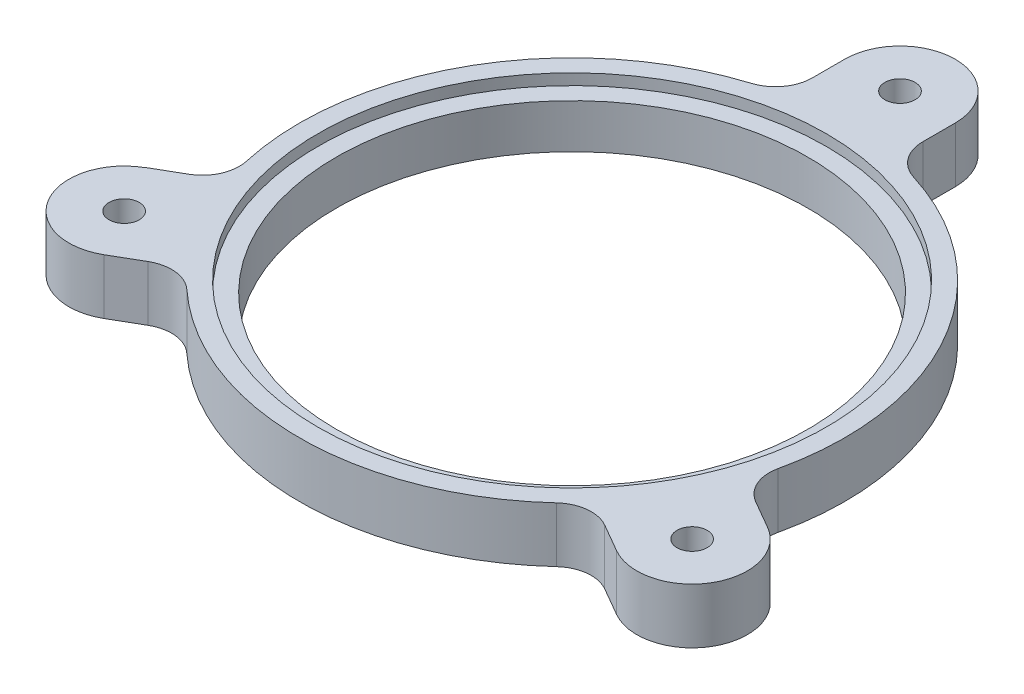
ISO-10303-21;
HEADER;
FILE_DESCRIPTION(('STEP AP214'),'2;1');
FILE_NAME('part.step','',(''),(''),'','','');
FILE_SCHEMA(('AUTOMOTIVE_DESIGN { 1 0 10303 214 1 1 1 1 }'));
ENDSEC;
DATA;
#1=APPLICATION_CONTEXT('core data for automotive mechanical design processes');
#2=APPLICATION_PROTOCOL_DEFINITION('international standard','automotive_design',2000,#1);
#3=PRODUCT_CONTEXT('',#1,'mechanical');
#4=PRODUCT('Part','Part','',(#3));
#5=PRODUCT_RELATED_PRODUCT_CATEGORY('part','',(#4));
#6=PRODUCT_DEFINITION_FORMATION('','',#4);
#7=PRODUCT_DEFINITION_CONTEXT('part definition',#1,'design');
#8=PRODUCT_DEFINITION('design','',#6,#7);
#9=PRODUCT_DEFINITION_SHAPE('','',#8);
#10=(LENGTH_UNIT() NAMED_UNIT(*) SI_UNIT(.MILLI.,.METRE.));
#11=(NAMED_UNIT(*) PLANE_ANGLE_UNIT() SI_UNIT($,.RADIAN.));
#12=(NAMED_UNIT(*) SI_UNIT($,.STERADIAN.) SOLID_ANGLE_UNIT());
#13=UNCERTAINTY_MEASURE_WITH_UNIT(LENGTH_MEASURE(1.E-05),#10,'distance_accuracy_value','');
#14=(GEOMETRIC_REPRESENTATION_CONTEXT(3) GLOBAL_UNCERTAINTY_ASSIGNED_CONTEXT((#13)) GLOBAL_UNIT_ASSIGNED_CONTEXT((#10,
#11,#12)) REPRESENTATION_CONTEXT('',''));
#15=CARTESIAN_POINT('',(0.,0.,0.));
#16=DIRECTION('',(0.,0.,1.));
#17=DIRECTION('',(1.,0.,0.));
#18=AXIS2_PLACEMENT_3D('',#15,#16,#17);
#19=CARTESIAN_POINT('',(77.0762609368114,15.,44.4999999999995));
#20=DIRECTION('',(0.,1.,0.));
#21=DIRECTION('',(0.,0.,1.));
#22=AXIS2_PLACEMENT_3D('',#19,#20,#21);
#23=PLANE('',#22);
#24=CARTESIAN_POINT('',(77.0762609368114,15.,44.4999999999995));
#25=DIRECTION('',(0.,1.,0.));
#26=DIRECTION('',(0.,0.,1.));
#27=AXIS2_PLACEMENT_3D('',#24,#25,#26);
#28=CIRCLE('',#27,4.1);
#29=CARTESIAN_POINT('',(77.0762609368114,15.,48.5999999999995));
#30=VERTEX_POINT('',#29);
#31=EDGE_CURVE('E701',#30,#30,#28,.T.);
#32=ORIENTED_EDGE('',*,*,#31,.F.);
#33=EDGE_LOOP('',(#32));
#34=FACE_BOUND('',#33,.T.);
#35=CARTESIAN_POINT('',(0.,15.,0.));
#36=DIRECTION('',(0.,1.,0.));
#37=DIRECTION('',(0.,0.,1.));
#38=AXIS2_PLACEMENT_3D('',#35,#36,#37);
#39=CIRCLE('',#38,69.);
#40=CARTESIAN_POINT('',(0.,15.,69.));
#41=VERTEX_POINT('',#40);
#42=EDGE_CURVE('E215',#41,#41,#39,.T.);
#43=ORIENTED_EDGE('',*,*,#42,.F.);
#44=EDGE_LOOP('',(#43));
#45=FACE_BOUND('',#44,.T.);
#46=CARTESIAN_POINT('',(77.0762609368114,15.,44.4999999999995));
#47=DIRECTION('',(0.,1.,0.));
#48=DIRECTION('',(0.,0.,1.));
#49=AXIS2_PLACEMENT_3D('',#46,#47,#48);
#50=CIRCLE('',#49,14.9999999999976);
#51=CARTESIAN_POINT('',(69.5762609368165,15.,57.4903810567636));
#52=VERTEX_POINT('',#51);
#53=CARTESIAN_POINT('',(84.5762609368146,15.,31.5096189432347));
#54=VERTEX_POINT('',#53);
#55=EDGE_CURVE('E266',#52,#54,#50,.T.);
#56=ORIENTED_EDGE('',*,*,#55,.T.);
#57=DIRECTION('',(-0.866025403784431,0.,-0.500000000000013));
#58=VECTOR('',#57,1.);
#59=CARTESIAN_POINT('',(84.5762609368146,15.,31.5096189432347));
#60=LINE('',#59,#58);
#61=CARTESIAN_POINT('',(76.9496220292086,15.,27.1063769169162));
#62=VERTEX_POINT('',#61);
#63=EDGE_CURVE('E136',#54,#62,#60,.T.);
#64=ORIENTED_EDGE('',*,*,#63,.T.);
#65=CARTESIAN_POINT('',(81.9496220292088,15.,18.4461228790719));
#66=DIRECTION('',(0.,-1.,0.));
#67=DIRECTION('',(0.,0.,-1.));
#68=AXIS2_PLACEMENT_3D('',#65,#66,#67);
#69=CIRCLE('',#68,10.);
#70=CARTESIAN_POINT('',(72.1937146447791,15.,16.2501558696586));
#71=VERTEX_POINT('',#70);
#72=EDGE_CURVE('E352',#62,#71,#69,.T.);
#73=ORIENTED_EDGE('',*,*,#72,.T.);
#74=CARTESIAN_POINT('',(0.,15.,0.));
#75=DIRECTION('',(0.,1.,0.));
#76=DIRECTION('',(0.,0.,1.));
#77=AXIS2_PLACEMENT_3D('',#74,#75,#76);
#78=CIRCLE('',#77,74.);
#79=CARTESIAN_POINT('',(22.0238095238095,15.,-70.6466688107724));
#80=VERTEX_POINT('',#79);
#81=EDGE_CURVE('E348',#71,#80,#78,.T.);
#82=ORIENTED_EDGE('',*,*,#81,.T.);
#83=CARTESIAN_POINT('',(25.,15.,-80.1935159473632));
#84=DIRECTION('',(0.,-1.,0.));
#85=DIRECTION('',(0.,0.,1.));
#86=AXIS2_PLACEMENT_3D('',#83,#84,#85);
#87=CIRCLE('',#86,9.99999999999999);
#88=CARTESIAN_POINT('',(15.,15.,-80.1935159473632));
#89=VERTEX_POINT('',#88);
#90=EDGE_CURVE('E351',#80,#89,#87,.T.);
#91=ORIENTED_EDGE('',*,*,#90,.T.);
#92=DIRECTION('',(0.,0.,-1.));
#93=VECTOR('',#92,1.);
#94=CARTESIAN_POINT('',(15.,15.,-89.));
#95=LINE('',#94,#93);
#96=CARTESIAN_POINT('',(15.,15.,-89.));
#97=VERTEX_POINT('',#96);
#98=EDGE_CURVE('E356',#89,#97,#95,.T.);
#99=ORIENTED_EDGE('',*,*,#98,.T.);
#100=CARTESIAN_POINT('',(0.,15.,-89.));
#101=DIRECTION('',(0.,1.,0.));
#102=DIRECTION('',(0.,0.,1.));
#103=AXIS2_PLACEMENT_3D('',#100,#101,#102);
#104=CIRCLE('',#103,15.);
#105=CARTESIAN_POINT('',(-15.,15.,-89.));
#106=VERTEX_POINT('',#105);
#107=EDGE_CURVE('E363',#97,#106,#104,.T.);
#108=ORIENTED_EDGE('',*,*,#107,.T.);
#109=DIRECTION('',(0.,0.,1.));
#110=VECTOR('',#109,1.);
#111=CARTESIAN_POINT('',(-15.,15.,-89.));
#112=LINE('',#111,#110);
#113=CARTESIAN_POINT('',(-15.,15.,-80.1935159473632));
#114=VERTEX_POINT('',#113);
#115=EDGE_CURVE('E366',#106,#114,#112,.T.);
#116=ORIENTED_EDGE('',*,*,#115,.T.);
#117=CARTESIAN_POINT('',(-25.,15.,-80.1935159473632));
#118=DIRECTION('',(0.,-1.,0.));
#119=DIRECTION('',(0.,0.,-1.));
#120=AXIS2_PLACEMENT_3D('',#117,#118,#119);
#121=CIRCLE('',#120,9.99999999999999);
#122=CARTESIAN_POINT('',(-22.0238095238095,15.,-70.6466688107724));
#123=VERTEX_POINT('',#122);
#124=EDGE_CURVE('E369',#114,#123,#121,.T.);
#125=ORIENTED_EDGE('',*,*,#124,.T.);
#126=CARTESIAN_POINT('',(0.,15.,0.));
#127=DIRECTION('',(0.,1.,0.));
#128=DIRECTION('',(0.,0.,1.));
#129=AXIS2_PLACEMENT_3D('',#126,#127,#128);
#130=CIRCLE('',#129,74.);
#131=CARTESIAN_POINT('',(-72.2066928386236,15.,16.1923904754259));
#132=VERTEX_POINT('',#131);
#133=EDGE_CURVE('E372',#123,#132,#130,.T.);
#134=ORIENTED_EDGE('',*,*,#133,.T.);
#135=CARTESIAN_POINT('',(-81.9643540330322,15.,18.3805513504834));
#136=DIRECTION('',(0.,-1.,0.));
#137=DIRECTION('',(0.,0.,1.));
#138=AXIS2_PLACEMENT_3D('',#135,#136,#137);
#139=CIRCLE('',#138,10.);
#140=CARTESIAN_POINT('',(-76.9643540330323,15.,27.0408053883279));
#141=VERTEX_POINT('',#140);
#142=EDGE_CURVE('E375',#132,#141,#139,.T.);
#143=ORIENTED_EDGE('',*,*,#142,.T.);
#144=DIRECTION('',(-0.866025403784442,0.,0.499999999999994));
#145=VECTOR('',#144,1.);
#146=CARTESIAN_POINT('',(-84.6083372425315,15.,31.4540611520132));
#147=LINE('',#146,#145);
#148=CARTESIAN_POINT('',(-84.6083372425315,15.,31.4540611520132));
#149=VERTEX_POINT('',#148);
#150=EDGE_CURVE('E378',#141,#149,#147,.T.);
#151=ORIENTED_EDGE('',*,*,#150,.T.);
#152=DIRECTION('',(0.49999999999983,0.,0.866025403784537));
#153=VECTOR('',#152,1.);
#154=CARTESIAN_POINT('',(-84.6083372425315,15.,31.4540611520132));
#155=LINE('',#154,#153);
#156=CARTESIAN_POINT('',(-84.5762609368152,15.,31.5096189432329));
#157=VERTEX_POINT('',#156);
#158=EDGE_CURVE('E381',#149,#157,#155,.T.);
#159=ORIENTED_EDGE('',*,*,#158,.T.);
#160=CARTESIAN_POINT('',(-77.0762609368153,15.,44.4999999999996));
#161=DIRECTION('',(0.,1.,0.));
#162=DIRECTION('',(0.,0.,1.));
#163=AXIS2_PLACEMENT_3D('',#160,#161,#162);
#164=CIRCLE('',#163,15.);
#165=CARTESIAN_POINT('',(-69.5762609368154,15.,57.4903810567662));
#166=VERTEX_POINT('',#165);
#167=EDGE_CURVE('E384',#157,#166,#164,.T.);
#168=ORIENTED_EDGE('',*,*,#167,.T.);
#169=DIRECTION('',(0.866025403784442,0.,-0.499999999999994));
#170=VECTOR('',#169,1.);
#171=CARTESIAN_POINT('',(-69.5762609368154,15.,57.4903810567662));
#172=LINE('',#171,#170);
#173=CARTESIAN_POINT('',(-61.9496220292093,15.,53.0871390304478));
#174=VERTEX_POINT('',#173);
#175=EDGE_CURVE('E387',#166,#174,#172,.T.);
#176=ORIENTED_EDGE('',*,*,#175,.T.);
#177=CARTESIAN_POINT('',(-56.9496220292094,15.,61.7473930682923));
#178=DIRECTION('',(0.,-1.,0.));
#179=DIRECTION('',(0.,0.,-1.));
#180=AXIS2_PLACEMENT_3D('',#177,#178,#179);
#181=CIRCLE('',#180,10.);
#182=CARTESIAN_POINT('',(-50.1699051209702,15.,54.3965129411146));
#183=VERTEX_POINT('',#182);
#184=EDGE_CURVE('E188',#174,#183,#181,.T.);
#185=ORIENTED_EDGE('',*,*,#184,.T.);
#186=CARTESIAN_POINT('',(0.,15.,0.));
#187=DIRECTION('',(0.,1.,0.));
#188=DIRECTION('',(0.,0.,1.));
#189=AXIS2_PLACEMENT_3D('',#186,#187,#188);
#190=CIRCLE('',#189,74.);
#191=CARTESIAN_POINT('',(50.1699051209705,15.,54.3965129411143));
#192=VERTEX_POINT('',#191);
#193=EDGE_CURVE('E182',#183,#192,#190,.T.);
#194=ORIENTED_EDGE('',*,*,#193,.T.);
#195=CARTESIAN_POINT('',(56.9496220292098,15.,61.7473930682919));
#196=DIRECTION('',(0.,-1.,0.));
#197=DIRECTION('',(0.,0.,1.));
#198=AXIS2_PLACEMENT_3D('',#195,#196,#197);
#199=CIRCLE('',#198,9.99999999999999);
#200=CARTESIAN_POINT('',(61.9496220292074,15.,53.0871390304461));
#201=VERTEX_POINT('',#200);
#202=EDGE_CURVE('E186',#192,#201,#199,.T.);
#203=ORIENTED_EDGE('',*,*,#202,.T.);
#204=DIRECTION('',(0.866025403784574,0.,0.499999999999765));
#205=VECTOR('',#204,1.);
#206=CARTESIAN_POINT('',(69.5762609368165,15.,57.4903810567636));
#207=LINE('',#206,#205);
#208=EDGE_CURVE('E59',#201,#52,#207,.T.);
#209=ORIENTED_EDGE('',*,*,#208,.T.);
#210=EDGE_LOOP('',(#56,#64,#73,#82,#91,#99,#108,#116,#125,#134,#143,#151,#159,#168,#176,#185,
#194,#203,#209));
#211=FACE_BOUND('',#210,.T.);
#212=CARTESIAN_POINT('',(-77.0762609368153,15.,44.4999999999996));
#213=DIRECTION('',(0.,1.,0.));
#214=DIRECTION('',(0.,0.,1.));
#215=AXIS2_PLACEMENT_3D('',#212,#213,#214);
#216=CIRCLE('',#215,4.1);
#217=CARTESIAN_POINT('',(-77.0762609368153,15.,48.5999999999996));
#218=VERTEX_POINT('',#217);
#219=EDGE_CURVE('E709',#218,#218,#216,.T.);
#220=ORIENTED_EDGE('',*,*,#219,.F.);
#221=EDGE_LOOP('',(#220));
#222=FACE_BOUND('',#221,.T.);
#223=CARTESIAN_POINT('',(0.,15.,-89.));
#224=DIRECTION('',(0.,1.,0.));
#225=DIRECTION('',(0.,0.,1.));
#226=AXIS2_PLACEMENT_3D('',#223,#224,#225);
#227=CIRCLE('',#226,4.1);
#228=CARTESIAN_POINT('',(0.,15.,-84.9));
#229=VERTEX_POINT('',#228);
#230=EDGE_CURVE('E693',#229,#229,#227,.T.);
#231=ORIENTED_EDGE('',*,*,#230,.F.);
#232=EDGE_LOOP('',(#231));
#233=FACE_BOUND('',#232,.T.);
#234=ADVANCED_FACE('F41',(#34,#45,#211,#222,#233),#23,.T.);
#235=CARTESIAN_POINT('',(77.0762609368114,0.,44.4999999999995));
#236=DIRECTION('',(0.,1.,0.));
#237=DIRECTION('',(0.,0.,1.));
#238=AXIS2_PLACEMENT_3D('',#235,#236,#237);
#239=PLANE('',#238);
#240=CARTESIAN_POINT('',(77.0762609368114,0.,44.4999999999995));
#241=DIRECTION('',(0.,1.,0.));
#242=DIRECTION('',(0.,0.,1.));
#243=AXIS2_PLACEMENT_3D('',#240,#241,#242);
#244=CIRCLE('',#243,14.9999999999976);
#245=CARTESIAN_POINT('',(69.5762609368165,0.,57.4903810567636));
#246=VERTEX_POINT('',#245);
#247=CARTESIAN_POINT('',(84.5762609368146,0.,31.5096189432347));
#248=VERTEX_POINT('',#247);
#249=EDGE_CURVE('E210',#246,#248,#244,.T.);
#250=ORIENTED_EDGE('',*,*,#249,.F.);
#251=DIRECTION('',(0.866025403784574,0.,0.499999999999765));
#252=VECTOR('',#251,1.);
#253=CARTESIAN_POINT('',(69.5762609368165,0.,57.4903810567636));
#254=LINE('',#253,#252);
#255=CARTESIAN_POINT('',(61.9496220292074,0.,53.0871390304461));
#256=VERTEX_POINT('',#255);
#257=EDGE_CURVE('E127',#256,#246,#254,.T.);
#258=ORIENTED_EDGE('',*,*,#257,.F.);
#259=CARTESIAN_POINT('',(56.9496220292098,0.,61.7473930682919));
#260=DIRECTION('',(0.,-1.,0.));
#261=DIRECTION('',(0.,0.,1.));
#262=AXIS2_PLACEMENT_3D('',#259,#260,#261);
#263=CIRCLE('',#262,9.99999999999999);
#264=CARTESIAN_POINT('',(50.1699051209705,0.,54.3965129411143));
#265=VERTEX_POINT('',#264);
#266=EDGE_CURVE('E121',#265,#256,#263,.T.);
#267=ORIENTED_EDGE('',*,*,#266,.F.);
#268=CARTESIAN_POINT('',(0.,0.,0.));
#269=DIRECTION('',(0.,1.,0.));
#270=DIRECTION('',(0.,0.,1.));
#271=AXIS2_PLACEMENT_3D('',#268,#269,#270);
#272=CIRCLE('',#271,74.);
#273=CARTESIAN_POINT('',(-50.1699051209702,0.,54.3965129411146));
#274=VERTEX_POINT('',#273);
#275=EDGE_CURVE('E197',#274,#265,#272,.T.);
#276=ORIENTED_EDGE('',*,*,#275,.F.);
#277=CARTESIAN_POINT('',(-56.9496220292094,0.,61.7473930682923));
#278=DIRECTION('',(0.,-1.,0.));
#279=DIRECTION('',(0.,0.,-1.));
#280=AXIS2_PLACEMENT_3D('',#277,#278,#279);
#281=CIRCLE('',#280,10.);
#282=CARTESIAN_POINT('',(-61.9496220292093,0.,53.0871390304478));
#283=VERTEX_POINT('',#282);
#284=EDGE_CURVE('E257',#283,#274,#281,.T.);
#285=ORIENTED_EDGE('',*,*,#284,.F.);
#286=DIRECTION('',(0.866025403784442,0.,-0.499999999999994));
#287=VECTOR('',#286,1.);
#288=CARTESIAN_POINT('',(-69.5762609368154,0.,57.4903810567662));
#289=LINE('',#288,#287);
#290=CARTESIAN_POINT('',(-69.5762609368154,0.,57.4903810567662));
#291=VERTEX_POINT('',#290);
#292=EDGE_CURVE('E254',#291,#283,#289,.T.);
#293=ORIENTED_EDGE('',*,*,#292,.F.);
#294=CARTESIAN_POINT('',(-77.0762609368153,0.,44.4999999999996));
#295=DIRECTION('',(0.,1.,0.));
#296=DIRECTION('',(0.,0.,1.));
#297=AXIS2_PLACEMENT_3D('',#294,#295,#296);
#298=CIRCLE('',#297,15.);
#299=CARTESIAN_POINT('',(-84.5762609368152,0.,31.5096189432329));
#300=VERTEX_POINT('',#299);
#301=EDGE_CURVE('E251',#300,#291,#298,.T.);
#302=ORIENTED_EDGE('',*,*,#301,.F.);
#303=DIRECTION('',(0.49999999999983,0.,0.866025403784537));
#304=VECTOR('',#303,1.);
#305=CARTESIAN_POINT('',(-84.6083372425315,0.,31.4540611520132));
#306=LINE('',#305,#304);
#307=CARTESIAN_POINT('',(-84.6083372425315,0.,31.4540611520132));
#308=VERTEX_POINT('',#307);
#309=EDGE_CURVE('E248',#308,#300,#306,.T.);
#310=ORIENTED_EDGE('',*,*,#309,.F.);
#311=DIRECTION('',(-0.866025403784442,0.,0.499999999999994));
#312=VECTOR('',#311,1.);
#313=CARTESIAN_POINT('',(-84.6083372425315,0.,31.4540611520132));
#314=LINE('',#313,#312);
#315=CARTESIAN_POINT('',(-76.9643540330323,0.,27.0408053883279));
#316=VERTEX_POINT('',#315);
#317=EDGE_CURVE('E245',#316,#308,#314,.T.);
#318=ORIENTED_EDGE('',*,*,#317,.F.);
#319=CARTESIAN_POINT('',(-81.9643540330322,0.,18.3805513504834));
#320=DIRECTION('',(0.,-1.,0.));
#321=DIRECTION('',(0.,0.,1.));
#322=AXIS2_PLACEMENT_3D('',#319,#320,#321);
#323=CIRCLE('',#322,10.);
#324=CARTESIAN_POINT('',(-72.2066928386236,0.,16.1923904754259));
#325=VERTEX_POINT('',#324);
#326=EDGE_CURVE('E242',#325,#316,#323,.T.);
#327=ORIENTED_EDGE('',*,*,#326,.F.);
#328=CARTESIAN_POINT('',(0.,0.,0.));
#329=DIRECTION('',(0.,1.,0.));
#330=DIRECTION('',(0.,0.,1.));
#331=AXIS2_PLACEMENT_3D('',#328,#329,#330);
#332=CIRCLE('',#331,74.);
#333=CARTESIAN_POINT('',(-22.0238095238095,0.,-70.6466688107724));
#334=VERTEX_POINT('',#333);
#335=EDGE_CURVE('E239',#334,#325,#332,.T.);
#336=ORIENTED_EDGE('',*,*,#335,.F.);
#337=CARTESIAN_POINT('',(-25.,0.,-80.1935159473632));
#338=DIRECTION('',(0.,-1.,0.));
#339=DIRECTION('',(0.,0.,-1.));
#340=AXIS2_PLACEMENT_3D('',#337,#338,#339);
#341=CIRCLE('',#340,9.99999999999999);
#342=CARTESIAN_POINT('',(-15.,0.,-80.1935159473632));
#343=VERTEX_POINT('',#342);
#344=EDGE_CURVE('E236',#343,#334,#341,.T.);
#345=ORIENTED_EDGE('',*,*,#344,.F.);
#346=DIRECTION('',(0.,0.,1.));
#347=VECTOR('',#346,1.);
#348=CARTESIAN_POINT('',(-15.,0.,-89.));
#349=LINE('',#348,#347);
#350=CARTESIAN_POINT('',(-15.,0.,-89.));
#351=VERTEX_POINT('',#350);
#352=EDGE_CURVE('E233',#351,#343,#349,.T.);
#353=ORIENTED_EDGE('',*,*,#352,.F.);
#354=CARTESIAN_POINT('',(0.,0.,-89.));
#355=DIRECTION('',(0.,1.,0.));
#356=DIRECTION('',(0.,0.,1.));
#357=AXIS2_PLACEMENT_3D('',#354,#355,#356);
#358=CIRCLE('',#357,15.);
#359=CARTESIAN_POINT('',(15.,0.,-89.));
#360=VERTEX_POINT('',#359);
#361=EDGE_CURVE('E230',#360,#351,#358,.T.);
#362=ORIENTED_EDGE('',*,*,#361,.F.);
#363=DIRECTION('',(0.,0.,-1.));
#364=VECTOR('',#363,1.);
#365=CARTESIAN_POINT('',(15.,0.,-89.));
#366=LINE('',#365,#364);
#367=CARTESIAN_POINT('',(15.,0.,-80.1935159473632));
#368=VERTEX_POINT('',#367);
#369=EDGE_CURVE('E227',#368,#360,#366,.T.);
#370=ORIENTED_EDGE('',*,*,#369,.F.);
#371=CARTESIAN_POINT('',(25.,0.,-80.1935159473632));
#372=DIRECTION('',(0.,-1.,0.));
#373=DIRECTION('',(0.,0.,1.));
#374=AXIS2_PLACEMENT_3D('',#371,#372,#373);
#375=CIRCLE('',#374,9.99999999999999);
#376=CARTESIAN_POINT('',(22.0238095238095,0.,-70.6466688107724));
#377=VERTEX_POINT('',#376);
#378=EDGE_CURVE('E224',#377,#368,#375,.T.);
#379=ORIENTED_EDGE('',*,*,#378,.F.);
#380=CARTESIAN_POINT('',(0.,0.,0.));
#381=DIRECTION('',(0.,1.,0.));
#382=DIRECTION('',(0.,0.,1.));
#383=AXIS2_PLACEMENT_3D('',#380,#381,#382);
#384=CIRCLE('',#383,74.);
#385=CARTESIAN_POINT('',(72.1937146447791,0.,16.2501558696586));
#386=VERTEX_POINT('',#385);
#387=EDGE_CURVE('E221',#386,#377,#384,.T.);
#388=ORIENTED_EDGE('',*,*,#387,.F.);
#389=CARTESIAN_POINT('',(81.9496220292088,0.,18.4461228790719));
#390=DIRECTION('',(0.,-1.,0.));
#391=DIRECTION('',(0.,0.,-1.));
#392=AXIS2_PLACEMENT_3D('',#389,#390,#391);
#393=CIRCLE('',#392,10.);
#394=CARTESIAN_POINT('',(76.9496220292086,0.,27.1063769169162));
#395=VERTEX_POINT('',#394);
#396=EDGE_CURVE('E218',#395,#386,#393,.T.);
#397=ORIENTED_EDGE('',*,*,#396,.F.);
#398=DIRECTION('',(-0.866025403784431,0.,-0.500000000000013));
#399=VECTOR('',#398,1.);
#400=CARTESIAN_POINT('',(84.5762609368146,0.,31.5096189432347));
#401=LINE('',#400,#399);
#402=EDGE_CURVE('E214',#248,#395,#401,.T.);
#403=ORIENTED_EDGE('',*,*,#402,.F.);
#404=EDGE_LOOP('',(#250,#258,#267,#276,#285,#293,#302,#310,#318,#327,#336,#345,#353,#362,#370,
#379,#388,#397,#403));
#405=FACE_BOUND('',#404,.T.);
#406=CARTESIAN_POINT('',(-77.0762609368153,0.,44.4999999999996));
#407=DIRECTION('',(0.,1.,0.));
#408=DIRECTION('',(0.,0.,1.));
#409=AXIS2_PLACEMENT_3D('',#406,#407,#408);
#410=CIRCLE('',#409,4.1);
#411=CARTESIAN_POINT('',(-77.0762609368153,0.,48.5999999999996));
#412=VERTEX_POINT('',#411);
#413=EDGE_CURVE('E705',#412,#412,#410,.T.);
#414=ORIENTED_EDGE('',*,*,#413,.T.);
#415=EDGE_LOOP('',(#414));
#416=FACE_BOUND('',#415,.T.);
#417=CARTESIAN_POINT('',(77.0762609368114,0.,44.4999999999995));
#418=DIRECTION('',(0.,1.,0.));
#419=DIRECTION('',(0.,0.,1.));
#420=AXIS2_PLACEMENT_3D('',#417,#418,#419);
#421=CIRCLE('',#420,4.1);
#422=CARTESIAN_POINT('',(77.0762609368114,0.,48.5999999999995));
#423=VERTEX_POINT('',#422);
#424=EDGE_CURVE('E697',#423,#423,#421,.T.);
#425=ORIENTED_EDGE('',*,*,#424,.T.);
#426=EDGE_LOOP('',(#425));
#427=FACE_BOUND('',#426,.T.);
#428=CARTESIAN_POINT('',(0.,0.,-89.));
#429=DIRECTION('',(0.,1.,0.));
#430=DIRECTION('',(0.,0.,1.));
#431=AXIS2_PLACEMENT_3D('',#428,#429,#430);
#432=CIRCLE('',#431,4.1);
#433=CARTESIAN_POINT('',(0.,0.,-84.9));
#434=VERTEX_POINT('',#433);
#435=EDGE_CURVE('E690',#434,#434,#432,.T.);
#436=ORIENTED_EDGE('',*,*,#435,.T.);
#437=EDGE_LOOP('',(#436));
#438=FACE_BOUND('',#437,.T.);
#439=CARTESIAN_POINT('',(0.,0.,0.));
#440=DIRECTION('',(0.,1.,0.));
#441=DIRECTION('',(0.,0.,1.));
#442=AXIS2_PLACEMENT_3D('',#439,#440,#441);
#443=CIRCLE('',#442,64.);
#444=CARTESIAN_POINT('',(0.,0.,64.));
#445=VERTEX_POINT('',#444);
#446=EDGE_CURVE('E685',#445,#445,#443,.T.);
#447=ORIENTED_EDGE('',*,*,#446,.T.);
#448=EDGE_LOOP('',(#447));
#449=FACE_BOUND('',#448,.T.);
#450=ADVANCED_FACE('F335',(#405,#416,#427,#438,#449),#239,.F.);
#451=CARTESIAN_POINT('',(77.0762609368114,15.,44.4999999999995));
#452=DIRECTION('',(0.,-1.,0.));
#453=DIRECTION('',(0.,0.,-1.));
#454=AXIS2_PLACEMENT_3D('',#451,#452,#453);
#455=CYLINDRICAL_SURFACE('',#454,14.9999999999976);
#456=ORIENTED_EDGE('',*,*,#249,.T.);
#457=DIRECTION('',(0.,-1.,0.));
#458=VECTOR('',#457,1.);
#459=CARTESIAN_POINT('',(84.5762609368146,15.,31.5096189432347));
#460=LINE('',#459,#458);
#461=EDGE_CURVE('E51',#54,#248,#460,.T.);
#462=ORIENTED_EDGE('',*,*,#461,.F.);
#463=ORIENTED_EDGE('',*,*,#55,.F.);
#464=DIRECTION('',(0.,-1.,0.));
#465=VECTOR('',#464,1.);
#466=CARTESIAN_POINT('',(69.5762609368165,15.,57.4903810567636));
#467=LINE('',#466,#465);
#468=EDGE_CURVE('E206',#52,#246,#467,.T.);
#469=ORIENTED_EDGE('',*,*,#468,.T.);
#470=EDGE_LOOP('',(#456,#462,#463,#469));
#471=FACE_BOUND('',#470,.T.);
#472=ADVANCED_FACE('F43',(#471),#455,.T.);
#473=CARTESIAN_POINT('',(84.5762609368146,15.,31.5096189432347));
#474=DIRECTION('',(-0.500000000000013,0.,0.866025403784431));
#475=DIRECTION('',(0.866025403784431,0.,0.500000000000013));
#476=AXIS2_PLACEMENT_3D('',#473,#474,#475);
#477=PLANE('',#476);
#478=ORIENTED_EDGE('',*,*,#402,.T.);
#479=DIRECTION('',(0.,-1.,0.));
#480=VECTOR('',#479,1.);
#481=CARTESIAN_POINT('',(76.9496220292086,15.,27.1063769169162));
#482=LINE('',#481,#480);
#483=EDGE_CURVE('E325',#62,#395,#482,.T.);
#484=ORIENTED_EDGE('',*,*,#483,.F.);
#485=ORIENTED_EDGE('',*,*,#63,.F.);
#486=ORIENTED_EDGE('',*,*,#461,.T.);
#487=EDGE_LOOP('',(#478,#484,#485,#486));
#488=FACE_BOUND('',#487,.T.);
#489=ADVANCED_FACE('F330',(#488),#477,.F.);
#490=CARTESIAN_POINT('',(81.9496220292088,15.,18.4461228790719));
#491=DIRECTION('',(0.,-1.,0.));
#492=DIRECTION('',(0.,0.,-1.));
#493=AXIS2_PLACEMENT_3D('',#490,#491,#492);
#494=CYLINDRICAL_SURFACE('',#493,10.);
#495=ORIENTED_EDGE('',*,*,#396,.T.);
#496=DIRECTION('',(0.,-1.,0.));
#497=VECTOR('',#496,1.);
#498=CARTESIAN_POINT('',(72.1937146447791,15.,16.2501558696586));
#499=LINE('',#498,#497);
#500=EDGE_CURVE('E321',#71,#386,#499,.T.);
#501=ORIENTED_EDGE('',*,*,#500,.F.);
#502=ORIENTED_EDGE('',*,*,#72,.F.);
#503=ORIENTED_EDGE('',*,*,#483,.T.);
#504=EDGE_LOOP('',(#495,#501,#502,#503));
#505=FACE_BOUND('',#504,.T.);
#506=ADVANCED_FACE('F342',(#505),#494,.F.);
#507=CARTESIAN_POINT('',(0.,15.,0.));
#508=DIRECTION('',(0.,-1.,0.));
#509=DIRECTION('',(0.,0.,-1.));
#510=AXIS2_PLACEMENT_3D('',#507,#508,#509);
#511=CYLINDRICAL_SURFACE('',#510,74.);
#512=ORIENTED_EDGE('',*,*,#387,.T.);
#513=DIRECTION('',(0.,-1.,0.));
#514=VECTOR('',#513,1.);
#515=CARTESIAN_POINT('',(22.0238095238095,15.,-70.6466688107724));
#516=LINE('',#515,#514);
#517=EDGE_CURVE('E317',#80,#377,#516,.T.);
#518=ORIENTED_EDGE('',*,*,#517,.F.);
#519=ORIENTED_EDGE('',*,*,#81,.F.);
#520=ORIENTED_EDGE('',*,*,#500,.T.);
#521=EDGE_LOOP('',(#512,#518,#519,#520));
#522=FACE_BOUND('',#521,.T.);
#523=ADVANCED_FACE('F346',(#522),#511,.T.);
#524=CARTESIAN_POINT('',(25.,15.,-80.1935159473632));
#525=DIRECTION('',(0.,-1.,0.));
#526=DIRECTION('',(0.,0.,-1.));
#527=AXIS2_PLACEMENT_3D('',#524,#525,#526);
#528=CYLINDRICAL_SURFACE('',#527,9.99999999999999);
#529=ORIENTED_EDGE('',*,*,#378,.T.);
#530=DIRECTION('',(0.,-1.,0.));
#531=VECTOR('',#530,1.);
#532=CARTESIAN_POINT('',(15.,15.,-80.1935159473632));
#533=LINE('',#532,#531);
#534=EDGE_CURVE('E313',#89,#368,#533,.T.);
#535=ORIENTED_EDGE('',*,*,#534,.F.);
#536=ORIENTED_EDGE('',*,*,#90,.F.);
#537=ORIENTED_EDGE('',*,*,#517,.T.);
#538=EDGE_LOOP('',(#529,#535,#536,#537));
#539=FACE_BOUND('',#538,.T.);
#540=ADVANCED_FACE('F445',(#539),#528,.F.);
#541=CARTESIAN_POINT('',(15.,15.,-89.));
#542=DIRECTION('',(-1.,0.,0.));
#543=DIRECTION('',(0.,0.,1.));
#544=AXIS2_PLACEMENT_3D('',#541,#542,#543);
#545=PLANE('',#544);
#546=ORIENTED_EDGE('',*,*,#369,.T.);
#547=DIRECTION('',(0.,-1.,0.));
#548=VECTOR('',#547,1.);
#549=CARTESIAN_POINT('',(15.,15.,-89.));
#550=LINE('',#549,#548);
#551=EDGE_CURVE('E309',#97,#360,#550,.T.);
#552=ORIENTED_EDGE('',*,*,#551,.F.);
#553=ORIENTED_EDGE('',*,*,#98,.F.);
#554=ORIENTED_EDGE('',*,*,#534,.T.);
#555=EDGE_LOOP('',(#546,#552,#553,#554));
#556=FACE_BOUND('',#555,.T.);
#557=ADVANCED_FACE('F442',(#556),#545,.F.);
#558=CARTESIAN_POINT('',(0.,15.,-89.));
#559=DIRECTION('',(0.,-1.,0.));
#560=DIRECTION('',(0.,0.,-1.));
#561=AXIS2_PLACEMENT_3D('',#558,#559,#560);
#562=CYLINDRICAL_SURFACE('',#561,15.);
#563=ORIENTED_EDGE('',*,*,#361,.T.);
#564=DIRECTION('',(0.,-1.,0.));
#565=VECTOR('',#564,1.);
#566=CARTESIAN_POINT('',(-15.,15.,-89.));
#567=LINE('',#566,#565);
#568=EDGE_CURVE('E305',#106,#351,#567,.T.);
#569=ORIENTED_EDGE('',*,*,#568,.F.);
#570=ORIENTED_EDGE('',*,*,#107,.F.);
#571=ORIENTED_EDGE('',*,*,#551,.T.);
#572=EDGE_LOOP('',(#563,#569,#570,#571));
#573=FACE_BOUND('',#572,.T.);
#574=ADVANCED_FACE('F438',(#573),#562,.T.);
#575=CARTESIAN_POINT('',(-15.,15.,-89.));
#576=DIRECTION('',(1.,0.,0.));
#577=DIRECTION('',(0.,0.,-1.));
#578=AXIS2_PLACEMENT_3D('',#575,#576,#577);
#579=PLANE('',#578);
#580=ORIENTED_EDGE('',*,*,#352,.T.);
#581=DIRECTION('',(0.,-1.,0.));
#582=VECTOR('',#581,1.);
#583=CARTESIAN_POINT('',(-15.,15.,-80.1935159473632));
#584=LINE('',#583,#582);
#585=EDGE_CURVE('E301',#114,#343,#584,.T.);
#586=ORIENTED_EDGE('',*,*,#585,.F.);
#587=ORIENTED_EDGE('',*,*,#115,.F.);
#588=ORIENTED_EDGE('',*,*,#568,.T.);
#589=EDGE_LOOP('',(#580,#586,#587,#588));
#590=FACE_BOUND('',#589,.T.);
#591=ADVANCED_FACE('F433',(#590),#579,.F.);
#592=CARTESIAN_POINT('',(-25.,15.,-80.1935159473632));
#593=DIRECTION('',(0.,-1.,0.));
#594=DIRECTION('',(0.,0.,-1.));
#595=AXIS2_PLACEMENT_3D('',#592,#593,#594);
#596=CYLINDRICAL_SURFACE('',#595,9.99999999999999);
#597=ORIENTED_EDGE('',*,*,#344,.T.);
#598=DIRECTION('',(0.,-1.,0.));
#599=VECTOR('',#598,1.);
#600=CARTESIAN_POINT('',(-22.0238095238095,15.,-70.6466688107724));
#601=LINE('',#600,#599);
#602=EDGE_CURVE('E297',#123,#334,#601,.T.);
#603=ORIENTED_EDGE('',*,*,#602,.F.);
#604=ORIENTED_EDGE('',*,*,#124,.F.);
#605=ORIENTED_EDGE('',*,*,#585,.T.);
#606=EDGE_LOOP('',(#597,#603,#604,#605));
#607=FACE_BOUND('',#606,.T.);
#608=ADVANCED_FACE('F427',(#607),#596,.F.);
#609=CARTESIAN_POINT('',(0.,15.,0.));
#610=DIRECTION('',(0.,-1.,0.));
#611=DIRECTION('',(0.,0.,-1.));
#612=AXIS2_PLACEMENT_3D('',#609,#610,#611);
#613=CYLINDRICAL_SURFACE('',#612,74.);
#614=ORIENTED_EDGE('',*,*,#335,.T.);
#615=DIRECTION('',(0.,-1.,0.));
#616=VECTOR('',#615,1.);
#617=CARTESIAN_POINT('',(-72.2066928386236,15.,16.1923904754259));
#618=LINE('',#617,#616);
#619=EDGE_CURVE('E293',#132,#325,#618,.T.);
#620=ORIENTED_EDGE('',*,*,#619,.F.);
#621=ORIENTED_EDGE('',*,*,#133,.F.);
#622=ORIENTED_EDGE('',*,*,#602,.T.);
#623=EDGE_LOOP('',(#614,#620,#621,#622));
#624=FACE_BOUND('',#623,.T.);
#625=ADVANCED_FACE('F423',(#624),#613,.T.);
#626=CARTESIAN_POINT('',(-81.9643540330322,15.,18.3805513504834));
#627=DIRECTION('',(0.,-1.,0.));
#628=DIRECTION('',(0.,0.,-1.));
#629=AXIS2_PLACEMENT_3D('',#626,#627,#628);
#630=CYLINDRICAL_SURFACE('',#629,10.);
#631=ORIENTED_EDGE('',*,*,#326,.T.);
#632=DIRECTION('',(0.,-1.,0.));
#633=VECTOR('',#632,1.);
#634=CARTESIAN_POINT('',(-76.9643540330323,15.,27.0408053883279));
#635=LINE('',#634,#633);
#636=EDGE_CURVE('E289',#141,#316,#635,.T.);
#637=ORIENTED_EDGE('',*,*,#636,.F.);
#638=ORIENTED_EDGE('',*,*,#142,.F.);
#639=ORIENTED_EDGE('',*,*,#619,.T.);
#640=EDGE_LOOP('',(#631,#637,#638,#639));
#641=FACE_BOUND('',#640,.T.);
#642=ADVANCED_FACE('F418',(#641),#630,.F.);
#643=CARTESIAN_POINT('',(-84.6083372425315,15.,31.4540611520132));
#644=DIRECTION('',(0.499999999999994,0.,0.866025403784442));
#645=DIRECTION('',(0.866025403784442,0.,-0.499999999999994));
#646=AXIS2_PLACEMENT_3D('',#643,#644,#645);
#647=PLANE('',#646);
#648=ORIENTED_EDGE('',*,*,#317,.T.);
#649=DIRECTION('',(0.,-1.,0.));
#650=VECTOR('',#649,1.);
#651=CARTESIAN_POINT('',(-84.6083372425315,15.,31.4540611520132));
#652=LINE('',#651,#650);
#653=EDGE_CURVE('E285',#149,#308,#652,.T.);
#654=ORIENTED_EDGE('',*,*,#653,.F.);
#655=ORIENTED_EDGE('',*,*,#150,.F.);
#656=ORIENTED_EDGE('',*,*,#636,.T.);
#657=EDGE_LOOP('',(#648,#654,#655,#656));
#658=FACE_BOUND('',#657,.T.);
#659=ADVANCED_FACE('F412',(#658),#647,.F.);
#660=CARTESIAN_POINT('',(-84.6083372425315,15.,31.4540611520132));
#661=DIRECTION('',(0.866025403784537,0.,-0.49999999999983));
#662=DIRECTION('',(-0.49999999999983,0.,-0.866025403784537));
#663=AXIS2_PLACEMENT_3D('',#660,#661,#662);
#664=PLANE('',#663);
#665=ORIENTED_EDGE('',*,*,#309,.T.);
#666=DIRECTION('',(0.,-1.,0.));
#667=VECTOR('',#666,1.);
#668=CARTESIAN_POINT('',(-84.5762609368152,15.,31.5096189432329));
#669=LINE('',#668,#667);
#670=EDGE_CURVE('E281',#157,#300,#669,.T.);
#671=ORIENTED_EDGE('',*,*,#670,.F.);
#672=ORIENTED_EDGE('',*,*,#158,.F.);
#673=ORIENTED_EDGE('',*,*,#653,.T.);
#674=EDGE_LOOP('',(#665,#671,#672,#673));
#675=FACE_BOUND('',#674,.T.);
#676=ADVANCED_FACE('F408',(#675),#664,.F.);
#677=CARTESIAN_POINT('',(-77.0762609368153,15.,44.4999999999996));
#678=DIRECTION('',(0.,-1.,0.));
#679=DIRECTION('',(0.,0.,-1.));
#680=AXIS2_PLACEMENT_3D('',#677,#678,#679);
#681=CYLINDRICAL_SURFACE('',#680,15.);
#682=ORIENTED_EDGE('',*,*,#301,.T.);
#683=DIRECTION('',(0.,-1.,0.));
#684=VECTOR('',#683,1.);
#685=CARTESIAN_POINT('',(-69.5762609368154,15.,57.4903810567662));
#686=LINE('',#685,#684);
#687=EDGE_CURVE('E277',#166,#291,#686,.T.);
#688=ORIENTED_EDGE('',*,*,#687,.F.);
#689=ORIENTED_EDGE('',*,*,#167,.F.);
#690=ORIENTED_EDGE('',*,*,#670,.T.);
#691=EDGE_LOOP('',(#682,#688,#689,#690));
#692=FACE_BOUND('',#691,.T.);
#693=ADVANCED_FACE('F404',(#692),#681,.T.);
#694=CARTESIAN_POINT('',(-69.5762609368154,15.,57.4903810567662));
#695=DIRECTION('',(-0.499999999999994,0.,-0.866025403784442));
#696=DIRECTION('',(-0.866025403784442,0.,0.499999999999994));
#697=AXIS2_PLACEMENT_3D('',#694,#695,#696);
#698=PLANE('',#697);
#699=ORIENTED_EDGE('',*,*,#292,.T.);
#700=DIRECTION('',(0.,-1.,0.));
#701=VECTOR('',#700,1.);
#702=CARTESIAN_POINT('',(-61.9496220292093,15.,53.0871390304478));
#703=LINE('',#702,#701);
#704=EDGE_CURVE('E273',#174,#283,#703,.T.);
#705=ORIENTED_EDGE('',*,*,#704,.F.);
#706=ORIENTED_EDGE('',*,*,#175,.F.);
#707=ORIENTED_EDGE('',*,*,#687,.T.);
#708=EDGE_LOOP('',(#699,#705,#706,#707));
#709=FACE_BOUND('',#708,.T.);
#710=ADVANCED_FACE('F395',(#709),#698,.F.);
#711=CARTESIAN_POINT('',(-56.9496220292094,15.,61.7473930682923));
#712=DIRECTION('',(0.,-1.,0.));
#713=DIRECTION('',(0.,0.,-1.));
#714=AXIS2_PLACEMENT_3D('',#711,#712,#713);
#715=CYLINDRICAL_SURFACE('',#714,10.);
#716=ORIENTED_EDGE('',*,*,#284,.T.);
#717=DIRECTION('',(0.,-1.,0.));
#718=VECTOR('',#717,1.);
#719=CARTESIAN_POINT('',(-50.1699051209702,15.,54.3965129411146));
#720=LINE('',#719,#718);
#721=EDGE_CURVE('E199',#183,#274,#720,.T.);
#722=ORIENTED_EDGE('',*,*,#721,.F.);
#723=ORIENTED_EDGE('',*,*,#184,.F.);
#724=ORIENTED_EDGE('',*,*,#704,.T.);
#725=EDGE_LOOP('',(#716,#722,#723,#724));
#726=FACE_BOUND('',#725,.T.);
#727=ADVANCED_FACE('F399',(#726),#715,.F.);
#728=CARTESIAN_POINT('',(0.,15.,0.));
#729=DIRECTION('',(0.,-1.,0.));
#730=DIRECTION('',(0.,0.,-1.));
#731=AXIS2_PLACEMENT_3D('',#728,#729,#730);
#732=CYLINDRICAL_SURFACE('',#731,74.);
#733=ORIENTED_EDGE('',*,*,#275,.T.);
#734=DIRECTION('',(0.,-1.,0.));
#735=VECTOR('',#734,1.);
#736=CARTESIAN_POINT('',(50.1699051209705,15.,54.3965129411143));
#737=LINE('',#736,#735);
#738=EDGE_CURVE('E194',#192,#265,#737,.T.);
#739=ORIENTED_EDGE('',*,*,#738,.F.);
#740=ORIENTED_EDGE('',*,*,#193,.F.);
#741=ORIENTED_EDGE('',*,*,#721,.T.);
#742=EDGE_LOOP('',(#733,#739,#740,#741));
#743=FACE_BOUND('',#742,.T.);
#744=ADVANCED_FACE('F195',(#743),#732,.T.);
#745=CARTESIAN_POINT('',(56.9496220292098,15.,61.7473930682919));
#746=DIRECTION('',(0.,-1.,0.));
#747=DIRECTION('',(0.,0.,-1.));
#748=AXIS2_PLACEMENT_3D('',#745,#746,#747);
#749=CYLINDRICAL_SURFACE('',#748,9.99999999999999);
#750=ORIENTED_EDGE('',*,*,#266,.T.);
#751=DIRECTION('',(0.,-1.,0.));
#752=VECTOR('',#751,1.);
#753=CARTESIAN_POINT('',(61.9496220292074,15.,53.0871390304461));
#754=LINE('',#753,#752);
#755=EDGE_CURVE('E200',#201,#256,#754,.T.);
#756=ORIENTED_EDGE('',*,*,#755,.F.);
#757=ORIENTED_EDGE('',*,*,#202,.F.);
#758=ORIENTED_EDGE('',*,*,#738,.T.);
#759=EDGE_LOOP('',(#750,#756,#757,#758));
#760=FACE_BOUND('',#759,.T.);
#761=ADVANCED_FACE('F202',(#760),#749,.F.);
#762=CARTESIAN_POINT('',(69.5762609368165,15.,57.4903810567636));
#763=DIRECTION('',(0.499999999999765,0.,-0.866025403784574));
#764=DIRECTION('',(-0.866025403784574,0.,-0.499999999999765));
#765=AXIS2_PLACEMENT_3D('',#762,#763,#764);
#766=PLANE('',#765);
#767=ORIENTED_EDGE('',*,*,#257,.T.);
#768=ORIENTED_EDGE('',*,*,#468,.F.);
#769=ORIENTED_EDGE('',*,*,#208,.F.);
#770=ORIENTED_EDGE('',*,*,#755,.T.);
#771=EDGE_LOOP('',(#767,#768,#769,#770));
#772=FACE_BOUND('',#771,.T.);
#773=ADVANCED_FACE('F467',(#772),#766,.F.);
#774=CARTESIAN_POINT('',(0.,15.,0.));
#775=DIRECTION('',(0.,-1.,0.));
#776=DIRECTION('',(0.,0.,-1.));
#777=AXIS2_PLACEMENT_3D('',#774,#775,#776);
#778=CYLINDRICAL_SURFACE('',#777,69.);
#779=CARTESIAN_POINT('',(0.,12.,0.));
#780=DIRECTION('',(0.,1.,0.));
#781=DIRECTION('',(0.,0.,1.));
#782=AXIS2_PLACEMENT_3D('',#779,#780,#781);
#783=CIRCLE('',#782,69.);
#784=CARTESIAN_POINT('',(0.,12.,69.));
#785=VERTEX_POINT('',#784);
#786=EDGE_CURVE('E11',#785,#785,#783,.T.);
#787=ORIENTED_EDGE('',*,*,#786,.F.);
#788=EDGE_LOOP('',(#787));
#789=FACE_BOUND('',#788,.T.);
#790=ORIENTED_EDGE('',*,*,#42,.T.);
#791=EDGE_LOOP('',(#790));
#792=FACE_BOUND('',#791,.T.);
#793=ADVANCED_FACE('F464',(#789,#792),#778,.F.);
#794=CARTESIAN_POINT('',(-77.0762609368153,15.,44.4999999999996));
#795=DIRECTION('',(0.,-1.,0.));
#796=DIRECTION('',(0.,0.,-1.));
#797=AXIS2_PLACEMENT_3D('',#794,#795,#796);
#798=CYLINDRICAL_SURFACE('',#797,4.1);
#799=ORIENTED_EDGE('',*,*,#219,.T.);
#800=EDGE_LOOP('',(#799));
#801=FACE_BOUND('',#800,.T.);
#802=ORIENTED_EDGE('',*,*,#413,.F.);
#803=EDGE_LOOP('',(#802));
#804=FACE_BOUND('',#803,.T.);
#805=ADVANCED_FACE('F552',(#801,#804),#798,.F.);
#806=CARTESIAN_POINT('',(77.0762609368114,15.,44.4999999999995));
#807=DIRECTION('',(0.,-1.,0.));
#808=DIRECTION('',(0.,0.,-1.));
#809=AXIS2_PLACEMENT_3D('',#806,#807,#808);
#810=CYLINDRICAL_SURFACE('',#809,4.1);
#811=ORIENTED_EDGE('',*,*,#31,.T.);
#812=EDGE_LOOP('',(#811));
#813=FACE_BOUND('',#812,.T.);
#814=ORIENTED_EDGE('',*,*,#424,.F.);
#815=EDGE_LOOP('',(#814));
#816=FACE_BOUND('',#815,.T.);
#817=ADVANCED_FACE('F560',(#813,#816),#810,.F.);
#818=CARTESIAN_POINT('',(0.,15.,-89.));
#819=DIRECTION('',(0.,-1.,0.));
#820=DIRECTION('',(0.,0.,-1.));
#821=AXIS2_PLACEMENT_3D('',#818,#819,#820);
#822=CYLINDRICAL_SURFACE('',#821,4.1);
#823=ORIENTED_EDGE('',*,*,#230,.T.);
#824=EDGE_LOOP('',(#823));
#825=FACE_BOUND('',#824,.T.);
#826=ORIENTED_EDGE('',*,*,#435,.F.);
#827=EDGE_LOOP('',(#826));
#828=FACE_BOUND('',#827,.T.);
#829=ADVANCED_FACE('F567',(#825,#828),#822,.F.);
#830=CARTESIAN_POINT('',(0.,12.,0.));
#831=DIRECTION('',(0.,1.,0.));
#832=DIRECTION('',(0.,0.,1.));
#833=AXIS2_PLACEMENT_3D('',#830,#831,#832);
#834=PLANE('',#833);
#835=ORIENTED_EDGE('',*,*,#786,.T.);
#836=EDGE_LOOP('',(#835));
#837=FACE_BOUND('',#836,.T.);
#838=CARTESIAN_POINT('',(0.,12.,0.));
#839=DIRECTION('',(0.,1.,0.));
#840=DIRECTION('',(0.,0.,1.));
#841=AXIS2_PLACEMENT_3D('',#838,#839,#840);
#842=CIRCLE('',#841,64.);
#843=CARTESIAN_POINT('',(0.,12.,64.));
#844=VERTEX_POINT('',#843);
#845=EDGE_CURVE('E682',#844,#844,#842,.T.);
#846=ORIENTED_EDGE('',*,*,#845,.F.);
#847=EDGE_LOOP('',(#846));
#848=FACE_BOUND('',#847,.T.);
#849=ADVANCED_FACE('F575',(#837,#848),#834,.T.);
#850=CARTESIAN_POINT('',(0.,12.,0.));
#851=DIRECTION('',(0.,-1.,0.));
#852=DIRECTION('',(0.,0.,-1.));
#853=AXIS2_PLACEMENT_3D('',#850,#851,#852);
#854=CYLINDRICAL_SURFACE('',#853,64.);
#855=ORIENTED_EDGE('',*,*,#845,.T.);
#856=EDGE_LOOP('',(#855));
#857=FACE_BOUND('',#856,.T.);
#858=ORIENTED_EDGE('',*,*,#446,.F.);
#859=EDGE_LOOP('',(#858));
#860=FACE_BOUND('',#859,.T.);
#861=ADVANCED_FACE('F582',(#857,#860),#854,.F.);
#862=CLOSED_SHELL('',(#234,#450,#472,#489,#506,#523,#540,#557,#574,#591,#608,#625,#642,#659,
#676,#693,#710,#727,#744,#761,#773,#793,#805,#817,#829,#849,#861));
#863=MANIFOLD_SOLID_BREP('B2',#862);
#864=ADVANCED_BREP_SHAPE_REPRESENTATION('',(#18,#863),#14);
#865=SHAPE_DEFINITION_REPRESENTATION(#9,#864);
ENDSEC;
END-ISO-10303-21;
